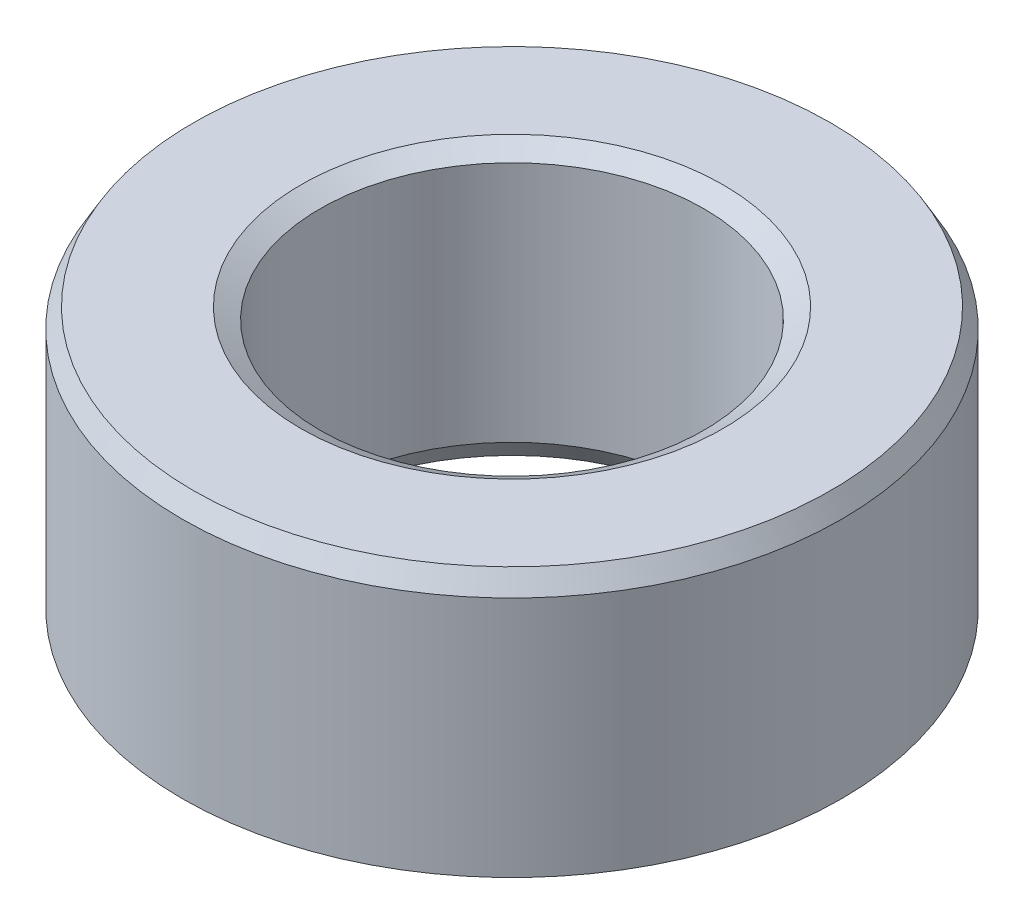
ISO-10303-21;
HEADER;
FILE_DESCRIPTION(('STEP AP214'),'2;1');
FILE_NAME('part.step','',(''),(''),'','','');
FILE_SCHEMA(('AUTOMOTIVE_DESIGN { 1 0 10303 214 1 1 1 1 }'));
ENDSEC;
DATA;
#1=APPLICATION_CONTEXT('core data for automotive mechanical design processes');
#2=APPLICATION_PROTOCOL_DEFINITION('international standard','automotive_design',2000,#1);
#3=PRODUCT_CONTEXT('',#1,'mechanical');
#4=PRODUCT('Part','Part','',(#3));
#5=PRODUCT_RELATED_PRODUCT_CATEGORY('part','',(#4));
#6=PRODUCT_DEFINITION_FORMATION('','',#4);
#7=PRODUCT_DEFINITION_CONTEXT('part definition',#1,'design');
#8=PRODUCT_DEFINITION('design','',#6,#7);
#9=PRODUCT_DEFINITION_SHAPE('','',#8);
#10=(LENGTH_UNIT() NAMED_UNIT(*) SI_UNIT(.MILLI.,.METRE.));
#11=(NAMED_UNIT(*) PLANE_ANGLE_UNIT() SI_UNIT($,.RADIAN.));
#12=(NAMED_UNIT(*) SI_UNIT($,.STERADIAN.) SOLID_ANGLE_UNIT());
#13=UNCERTAINTY_MEASURE_WITH_UNIT(LENGTH_MEASURE(1.E-05),#10,'distance_accuracy_value','');
#14=(GEOMETRIC_REPRESENTATION_CONTEXT(3) GLOBAL_UNCERTAINTY_ASSIGNED_CONTEXT((#13)) GLOBAL_UNIT_ASSIGNED_CONTEXT((#10,
#11,#12)) REPRESENTATION_CONTEXT('',''));
#15=CARTESIAN_POINT('',(0.,0.,0.));
#16=DIRECTION('',(0.,0.,1.));
#17=DIRECTION('',(1.,0.,0.));
#18=AXIS2_PLACEMENT_3D('',#15,#16,#17);
#19=CARTESIAN_POINT('',(0.,41.3057514964543,0.));
#20=DIRECTION('',(0.,-1.,0.));
#21=DIRECTION('',(0.,0.,-1.));
#22=AXIS2_PLACEMENT_3D('',#19,#20,#21);
#23=CYLINDRICAL_SURFACE('',#22,50.);
#24=CARTESIAN_POINT('',(0.,1.68256889403749,0.));
#25=DIRECTION('',(0.,1.,0.));
#26=DIRECTION('',(0.,0.,1.));
#27=AXIS2_PLACEMENT_3D('',#24,#25,#26);
#28=CIRCLE('',#27,50.);
#29=CARTESIAN_POINT('',(0.,1.68256889403749,50.));
#30=VERTEX_POINT('',#29);
#31=EDGE_CURVE('E10',#30,#30,#28,.T.);
#32=ORIENTED_EDGE('',*,*,#31,.T.);
#33=EDGE_LOOP('',(#32));
#34=FACE_BOUND('',#33,.T.);
#35=CARTESIAN_POINT('',(0.,38.3914566847463,0.));
#36=DIRECTION('',(0.,1.,0.));
#37=DIRECTION('',(0.,0.,1.));
#38=AXIS2_PLACEMENT_3D('',#35,#36,#37);
#39=CIRCLE('',#38,50.);
#40=CARTESIAN_POINT('',(0.,38.3914566847463,50.));
#41=VERTEX_POINT('',#40);
#42=EDGE_CURVE('E50',#41,#41,#39,.F.);
#43=ORIENTED_EDGE('',*,*,#42,.T.);
#44=EDGE_LOOP('',(#43));
#45=FACE_BOUND('',#44,.T.);
#46=ADVANCED_FACE('F39',(#34,#45),#23,.T.);
#47=CARTESIAN_POINT('',(0.,41.3057514964543,0.));
#48=DIRECTION('',(0.,1.,0.));
#49=DIRECTION('',(0.,0.,1.));
#50=AXIS2_PLACEMENT_3D('',#47,#48,#49);
#51=PLANE('',#50);
#52=CARTESIAN_POINT('',(0.,41.3057514964543,0.));
#53=DIRECTION('',(0.,1.,0.));
#54=DIRECTION('',(0.,0.,1.));
#55=AXIS2_PLACEMENT_3D('',#52,#53,#54);
#56=CIRCLE('',#55,32.0228887707819);
#57=CARTESIAN_POINT('',(0.,41.3057514964543,32.0228887707819));
#58=VERTEX_POINT('',#57);
#59=EDGE_CURVE('E58',#58,#58,#56,.F.);
#60=ORIENTED_EDGE('',*,*,#59,.T.);
#61=EDGE_LOOP('',(#60));
#62=FACE_BOUND('',#61,.T.);
#63=CARTESIAN_POINT('',(0.,41.3057514964543,0.));
#64=DIRECTION('',(0.,1.,0.));
#65=DIRECTION('',(0.,0.,1.));
#66=AXIS2_PLACEMENT_3D('',#63,#64,#65);
#67=CIRCLE('',#66,48.3174311059625);
#68=CARTESIAN_POINT('',(0.,41.3057514964543,48.3174311059625));
#69=VERTEX_POINT('',#68);
#70=EDGE_CURVE('E61',#69,#69,#67,.T.);
#71=ORIENTED_EDGE('',*,*,#70,.T.);
#72=EDGE_LOOP('',(#71));
#73=FACE_BOUND('',#72,.T.);
#74=ADVANCED_FACE('F88',(#62,#73),#51,.T.);
#75=CARTESIAN_POINT('',(0.,0.,0.));
#76=DIRECTION('',(0.,1.,0.));
#77=DIRECTION('',(0.,0.,1.));
#78=AXIS2_PLACEMENT_3D('',#75,#76,#77);
#79=PLANE('',#78);
#80=CARTESIAN_POINT('',(0.,0.,0.));
#81=DIRECTION('',(0.,1.,0.));
#82=DIRECTION('',(0.,0.,1.));
#83=AXIS2_PLACEMENT_3D('',#80,#81,#82);
#84=CIRCLE('',#83,30.7911628531115);
#85=CARTESIAN_POINT('',(0.,0.,30.7911628531115));
#86=VERTEX_POINT('',#85);
#87=EDGE_CURVE('E51',#86,#86,#84,.T.);
#88=ORIENTED_EDGE('',*,*,#87,.T.);
#89=EDGE_LOOP('',(#88));
#90=FACE_BOUND('',#89,.T.);
#91=CARTESIAN_POINT('',(0.,0.,0.));
#92=DIRECTION('',(0.,1.,0.));
#93=DIRECTION('',(0.,0.,1.));
#94=AXIS2_PLACEMENT_3D('',#91,#92,#93);
#95=CIRCLE('',#94,47.0857051882921);
#96=CARTESIAN_POINT('',(0.,0.,47.0857051882921));
#97=VERTEX_POINT('',#96);
#98=EDGE_CURVE('E54',#97,#97,#95,.F.);
#99=ORIENTED_EDGE('',*,*,#98,.T.);
#100=EDGE_LOOP('',(#99));
#101=FACE_BOUND('',#100,.T.);
#102=ADVANCED_FACE('F83',(#90,#101),#79,.F.);
#103=CARTESIAN_POINT('',(0.,41.3057514964543,0.));
#104=DIRECTION('',(0.,-1.,0.));
#105=DIRECTION('',(0.,0.,-1.));
#106=AXIS2_PLACEMENT_3D('',#103,#104,#105);
#107=CYLINDRICAL_SURFACE('',#106,29.108593959074);
#108=CARTESIAN_POINT('',(0.,39.6231826024168,0.));
#109=DIRECTION('',(0.,1.,0.));
#110=DIRECTION('',(0.,0.,1.));
#111=AXIS2_PLACEMENT_3D('',#108,#109,#110);
#112=CIRCLE('',#111,29.108593959074);
#113=CARTESIAN_POINT('',(0.,39.6231826024168,29.108593959074));
#114=VERTEX_POINT('',#113);
#115=EDGE_CURVE('E67',#114,#114,#112,.T.);
#116=ORIENTED_EDGE('',*,*,#115,.T.);
#117=EDGE_LOOP('',(#116));
#118=FACE_BOUND('',#117,.T.);
#119=CARTESIAN_POINT('',(0.,2.91429481170801,0.));
#120=DIRECTION('',(0.,1.,0.));
#121=DIRECTION('',(0.,0.,1.));
#122=AXIS2_PLACEMENT_3D('',#119,#120,#121);
#123=CIRCLE('',#122,29.108593959074);
#124=CARTESIAN_POINT('',(0.,2.91429481170801,29.108593959074));
#125=VERTEX_POINT('',#124);
#126=EDGE_CURVE('E69',#125,#125,#123,.F.);
#127=ORIENTED_EDGE('',*,*,#126,.T.);
#128=EDGE_LOOP('',(#127));
#129=FACE_BOUND('',#128,.T.);
#130=ADVANCED_FACE('F71',(#118,#129),#107,.F.);
#131=CARTESIAN_POINT('',(0.,39.6231826024168,0.));
#132=DIRECTION('',(0.,1.,0.));
#133=DIRECTION('',(0.,0.,1.));
#134=AXIS2_PLACEMENT_3D('',#131,#132,#133);
#135=CONICAL_SURFACE('',#134,29.108593959074,1.0471975511966);
#136=ORIENTED_EDGE('',*,*,#59,.F.);
#137=EDGE_LOOP('',(#136));
#138=FACE_BOUND('',#137,.T.);
#139=ORIENTED_EDGE('',*,*,#115,.F.);
#140=EDGE_LOOP('',(#139));
#141=FACE_BOUND('',#140,.T.);
#142=ADVANCED_FACE('F77',(#138,#141),#135,.F.);
#143=CARTESIAN_POINT('',(0.,0.,0.));
#144=DIRECTION('',(0.,-1.,0.));
#145=DIRECTION('',(0.,0.,-1.));
#146=AXIS2_PLACEMENT_3D('',#143,#144,#145);
#147=CONICAL_SURFACE('',#146,30.7911628531115,0.523598775598295);
#148=ORIENTED_EDGE('',*,*,#126,.F.);
#149=EDGE_LOOP('',(#148));
#150=FACE_BOUND('',#149,.T.);
#151=ORIENTED_EDGE('',*,*,#87,.F.);
#152=EDGE_LOOP('',(#151));
#153=FACE_BOUND('',#152,.T.);
#154=ADVANCED_FACE('F73',(#150,#153),#147,.F.);
#155=CARTESIAN_POINT('',(0.,1.68256889403749,0.));
#156=DIRECTION('',(0.,1.,0.));
#157=DIRECTION('',(0.,0.,1.));
#158=AXIS2_PLACEMENT_3D('',#155,#156,#157);
#159=CONICAL_SURFACE('',#158,50.,1.0471975511966);
#160=ORIENTED_EDGE('',*,*,#98,.F.);
#161=EDGE_LOOP('',(#160));
#162=FACE_BOUND('',#161,.T.);
#163=ORIENTED_EDGE('',*,*,#31,.F.);
#164=EDGE_LOOP('',(#163));
#165=FACE_BOUND('',#164,.T.);
#166=ADVANCED_FACE('F76',(#162,#165),#159,.T.);
#167=CARTESIAN_POINT('',(0.,41.3057514964543,0.));
#168=DIRECTION('',(0.,-1.,0.));
#169=DIRECTION('',(0.,0.,-1.));
#170=AXIS2_PLACEMENT_3D('',#167,#168,#169);
#171=CONICAL_SURFACE('',#170,48.3174311059625,0.523598775598295);
#172=ORIENTED_EDGE('',*,*,#42,.F.);
#173=EDGE_LOOP('',(#172));
#174=FACE_BOUND('',#173,.T.);
#175=ORIENTED_EDGE('',*,*,#70,.F.);
#176=EDGE_LOOP('',(#175));
#177=FACE_BOUND('',#176,.T.);
#178=ADVANCED_FACE('F45',(#174,#177),#171,.T.);
#179=CLOSED_SHELL('',(#46,#74,#102,#130,#142,#154,#166,#178));
#180=MANIFOLD_SOLID_BREP('B2',#179);
#181=ADVANCED_BREP_SHAPE_REPRESENTATION('',(#18,#180),#14);
#182=SHAPE_DEFINITION_REPRESENTATION(#9,#181);
ENDSEC;
END-ISO-10303-21;
